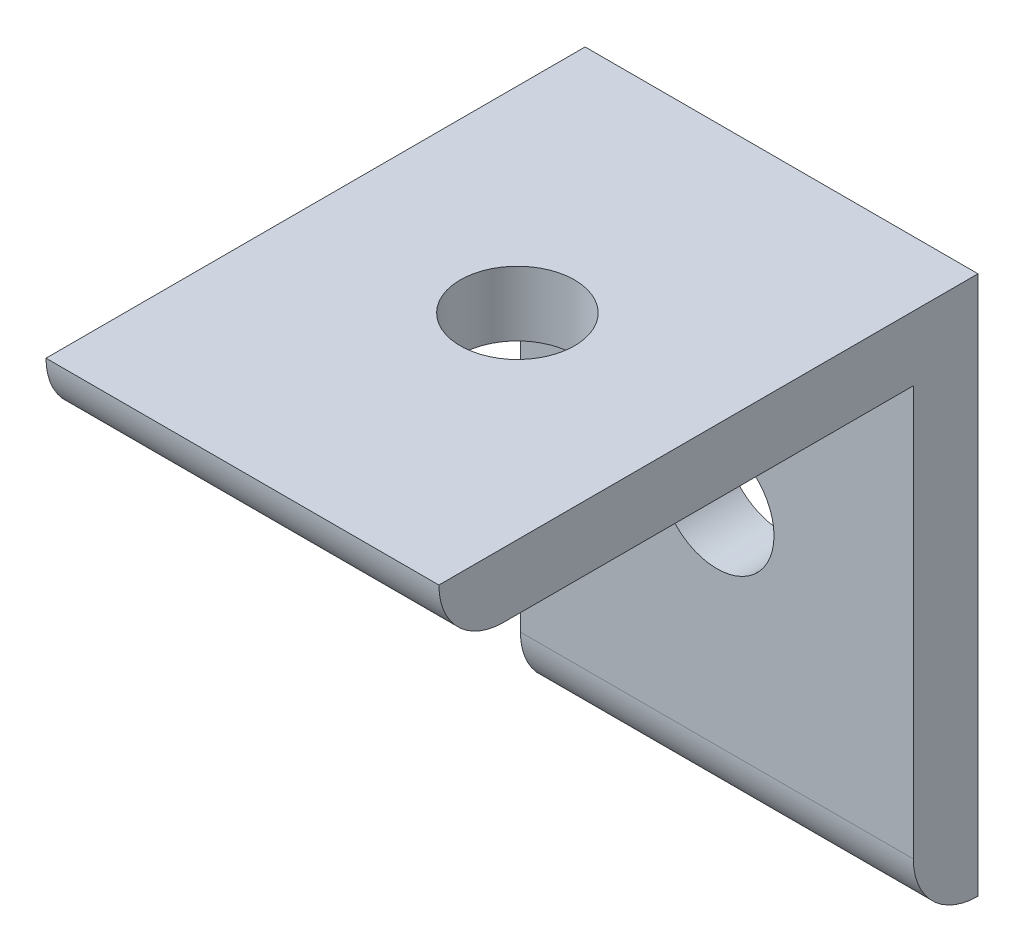
ISO-10303-21;
HEADER;
FILE_DESCRIPTION(('STEP AP214'),'2;1');
FILE_NAME('part.step','',(''),(''),'','','');
FILE_SCHEMA(('AUTOMOTIVE_DESIGN { 1 0 10303 214 1 1 1 1 }'));
ENDSEC;
DATA;
#1=APPLICATION_CONTEXT('core data for automotive mechanical design processes');
#2=APPLICATION_PROTOCOL_DEFINITION('international standard','automotive_design',2000,#1);
#3=PRODUCT_CONTEXT('',#1,'mechanical');
#4=PRODUCT('Part','Part','',(#3));
#5=PRODUCT_RELATED_PRODUCT_CATEGORY('part','',(#4));
#6=PRODUCT_DEFINITION_FORMATION('','',#4);
#7=PRODUCT_DEFINITION_CONTEXT('part definition',#1,'design');
#8=PRODUCT_DEFINITION('design','',#6,#7);
#9=PRODUCT_DEFINITION_SHAPE('','',#8);
#10=(LENGTH_UNIT() NAMED_UNIT(*) SI_UNIT(.MILLI.,.METRE.));
#11=(NAMED_UNIT(*) PLANE_ANGLE_UNIT() SI_UNIT($,.RADIAN.));
#12=(NAMED_UNIT(*) SI_UNIT($,.STERADIAN.) SOLID_ANGLE_UNIT());
#13=UNCERTAINTY_MEASURE_WITH_UNIT(LENGTH_MEASURE(1.E-05),#10,'distance_accuracy_value','');
#14=(GEOMETRIC_REPRESENTATION_CONTEXT(3) GLOBAL_UNCERTAINTY_ASSIGNED_CONTEXT((#13)) GLOBAL_UNIT_ASSIGNED_CONTEXT((#10,
#11,#12)) REPRESENTATION_CONTEXT('',''));
#15=CARTESIAN_POINT('',(0.,0.,0.));
#16=DIRECTION('',(0.,0.,1.));
#17=DIRECTION('',(1.,0.,0.));
#18=AXIS2_PLACEMENT_3D('',#15,#16,#17);
#19=CARTESIAN_POINT('',(-88.5808864008386,-309.665681156461,3.));
#20=DIRECTION('',(1.,0.,0.));
#21=DIRECTION('',(0.,0.,-1.));
#22=AXIS2_PLACEMENT_3D('',#19,#20,#21);
#23=PLANE('',#22);
#24=DIRECTION('',(0.,0.,-1.));
#25=VECTOR('',#24,1.);
#26=CARTESIAN_POINT('',(-88.5808864008386,-312.665681156461,25.));
#27=LINE('',#26,#25);
#28=CARTESIAN_POINT('',(-88.5808864008386,-312.665681156461,22.));
#29=VERTEX_POINT('',#28);
#30=CARTESIAN_POINT('',(-88.5808864008386,-312.665681156461,3.));
#31=VERTEX_POINT('',#30);
#32=EDGE_CURVE('E115',#29,#31,#27,.T.);
#33=ORIENTED_EDGE('',*,*,#32,.F.);
#34=CARTESIAN_POINT('',(-88.5808864008386,-309.665681156461,22.));
#35=DIRECTION('',(1.,0.,0.));
#36=DIRECTION('',(0.,0.,-1.));
#37=AXIS2_PLACEMENT_3D('',#34,#35,#36);
#38=CIRCLE('',#37,3.);
#39=CARTESIAN_POINT('',(-88.5808864008386,-309.665681156461,25.));
#40=VERTEX_POINT('',#39);
#41=EDGE_CURVE('E43',#29,#40,#38,.F.);
#42=ORIENTED_EDGE('',*,*,#41,.T.);
#43=DIRECTION('',(0.,0.,-1.));
#44=VECTOR('',#43,1.);
#45=CARTESIAN_POINT('',(-88.5808864008386,-309.665681156461,3.));
#46=LINE('',#45,#44);
#47=CARTESIAN_POINT('',(-88.5808864008386,-309.665681156461,0.));
#48=VERTEX_POINT('',#47);
#49=EDGE_CURVE('E107',#40,#48,#46,.T.);
#50=ORIENTED_EDGE('',*,*,#49,.T.);
#51=DIRECTION('',(0.,-1.,0.));
#52=VECTOR('',#51,1.);
#53=CARTESIAN_POINT('',(-88.5808864008386,-309.665681156461,0.));
#54=LINE('',#53,#52);
#55=CARTESIAN_POINT('',(-88.5808864008386,-334.665681156461,0.));
#56=VERTEX_POINT('',#55);
#57=EDGE_CURVE('E140',#48,#56,#54,.T.);
#58=ORIENTED_EDGE('',*,*,#57,.T.);
#59=CARTESIAN_POINT('',(-88.5808864008386,-331.665681156461,0.));
#60=DIRECTION('',(1.,0.,0.));
#61=DIRECTION('',(0.,0.,-1.));
#62=AXIS2_PLACEMENT_3D('',#59,#60,#61);
#63=CIRCLE('',#62,3.);
#64=CARTESIAN_POINT('',(-88.5808864008386,-331.665681156461,3.));
#65=VERTEX_POINT('',#64);
#66=EDGE_CURVE('E50',#56,#65,#63,.F.);
#67=ORIENTED_EDGE('',*,*,#66,.T.);
#68=DIRECTION('',(0.,-1.,0.));
#69=VECTOR('',#68,1.);
#70=CARTESIAN_POINT('',(-88.5808864008386,-309.665681156461,3.));
#71=LINE('',#70,#69);
#72=EDGE_CURVE('E130',#31,#65,#71,.T.);
#73=ORIENTED_EDGE('',*,*,#72,.F.);
#74=EDGE_LOOP('',(#33,#42,#50,#58,#67,#73));
#75=FACE_BOUND('',#74,.T.);
#76=ADVANCED_FACE('F35',(#75),#23,.F.);
#77=CARTESIAN_POINT('',(-70.3608864008386,-309.665681156461,3.));
#78=DIRECTION('',(-1.,0.,0.));
#79=DIRECTION('',(0.,0.,1.));
#80=AXIS2_PLACEMENT_3D('',#77,#78,#79);
#81=PLANE('',#80);
#82=DIRECTION('',(0.,0.,-1.));
#83=VECTOR('',#82,1.);
#84=CARTESIAN_POINT('',(-70.3608864008386,-309.665681156461,3.));
#85=LINE('',#84,#83);
#86=CARTESIAN_POINT('',(-70.3608864008386,-309.665681156461,25.));
#87=VERTEX_POINT('',#86);
#88=CARTESIAN_POINT('',(-70.3608864008386,-309.665681156461,0.));
#89=VERTEX_POINT('',#88);
#90=EDGE_CURVE('E101',#87,#89,#85,.T.);
#91=ORIENTED_EDGE('',*,*,#90,.F.);
#92=CARTESIAN_POINT('',(-70.3608864008386,-309.665681156461,22.));
#93=DIRECTION('',(-1.,0.,0.));
#94=DIRECTION('',(0.,0.,1.));
#95=AXIS2_PLACEMENT_3D('',#92,#93,#94);
#96=CIRCLE('',#95,3.);
#97=CARTESIAN_POINT('',(-70.3608864008386,-312.665681156461,22.));
#98=VERTEX_POINT('',#97);
#99=EDGE_CURVE('E90',#87,#98,#96,.F.);
#100=ORIENTED_EDGE('',*,*,#99,.T.);
#101=DIRECTION('',(0.,0.,-1.));
#102=VECTOR('',#101,1.);
#103=CARTESIAN_POINT('',(-70.3608864008386,-312.665681156461,25.));
#104=LINE('',#103,#102);
#105=CARTESIAN_POINT('',(-70.3608864008386,-312.665681156461,3.));
#106=VERTEX_POINT('',#105);
#107=EDGE_CURVE('E112',#98,#106,#104,.T.);
#108=ORIENTED_EDGE('',*,*,#107,.T.);
#109=DIRECTION('',(0.,1.,0.));
#110=VECTOR('',#109,1.);
#111=CARTESIAN_POINT('',(-70.3608864008386,-309.665681156461,3.));
#112=LINE('',#111,#110);
#113=CARTESIAN_POINT('',(-70.3608864008386,-331.665681156461,3.));
#114=VERTEX_POINT('',#113);
#115=EDGE_CURVE('E136',#114,#106,#112,.T.);
#116=ORIENTED_EDGE('',*,*,#115,.F.);
#117=CARTESIAN_POINT('',(-70.3608864008386,-331.665681156461,0.));
#118=DIRECTION('',(-1.,0.,0.));
#119=DIRECTION('',(0.,0.,1.));
#120=AXIS2_PLACEMENT_3D('',#117,#118,#119);
#121=CIRCLE('',#120,3.);
#122=CARTESIAN_POINT('',(-70.3608864008386,-334.665681156461,0.));
#123=VERTEX_POINT('',#122);
#124=EDGE_CURVE('E98',#114,#123,#121,.F.);
#125=ORIENTED_EDGE('',*,*,#124,.T.);
#126=DIRECTION('',(0.,1.,0.));
#127=VECTOR('',#126,1.);
#128=CARTESIAN_POINT('',(-70.3608864008386,-309.665681156461,0.));
#129=LINE('',#128,#127);
#130=EDGE_CURVE('E104',#123,#89,#129,.T.);
#131=ORIENTED_EDGE('',*,*,#130,.T.);
#132=EDGE_LOOP('',(#91,#100,#108,#116,#125,#131));
#133=FACE_BOUND('',#132,.T.);
#134=ADVANCED_FACE('F102',(#133),#81,.F.);
#135=CARTESIAN_POINT('',(-88.5808864008386,-309.665681156461,3.));
#136=DIRECTION('',(0.,-1.,0.));
#137=DIRECTION('',(0.,0.,-1.));
#138=AXIS2_PLACEMENT_3D('',#135,#136,#137);
#139=PLANE('',#138);
#140=CARTESIAN_POINT('',(-79.4708864008386,-309.665681156461,12.25));
#141=DIRECTION('',(0.,-1.,0.));
#142=DIRECTION('',(0.,0.,-1.));
#143=AXIS2_PLACEMENT_3D('',#140,#141,#142);
#144=CIRCLE('',#143,2.65);
#145=CARTESIAN_POINT('',(-79.4708864008386,-309.665681156461,9.6));
#146=VERTEX_POINT('',#145);
#147=EDGE_CURVE('E202',#146,#146,#144,.T.);
#148=ORIENTED_EDGE('',*,*,#147,.T.);
#149=EDGE_LOOP('',(#148));
#150=FACE_BOUND('',#149,.T.);
#151=DIRECTION('',(-1.,0.,0.));
#152=VECTOR('',#151,1.);
#153=CARTESIAN_POINT('',(-88.5808864008386,-309.665681156461,0.));
#154=LINE('',#153,#152);
#155=EDGE_CURVE('E146',#89,#48,#154,.T.);
#156=ORIENTED_EDGE('',*,*,#155,.T.);
#157=ORIENTED_EDGE('',*,*,#49,.F.);
#158=DIRECTION('',(-1.,0.,0.));
#159=VECTOR('',#158,1.);
#160=CARTESIAN_POINT('',(-88.5808864008386,-309.665681156461,25.));
#161=LINE('',#160,#159);
#162=EDGE_CURVE('E95',#87,#40,#161,.T.);
#163=ORIENTED_EDGE('',*,*,#162,.F.);
#164=ORIENTED_EDGE('',*,*,#90,.T.);
#165=EDGE_LOOP('',(#156,#157,#163,#164));
#166=FACE_BOUND('',#165,.T.);
#167=ADVANCED_FACE('F110',(#150,#166),#139,.F.);
#168=CARTESIAN_POINT('',(0.,0.,3.));
#169=DIRECTION('',(0.,0.,1.));
#170=DIRECTION('',(1.,0.,0.));
#171=AXIS2_PLACEMENT_3D('',#168,#169,#170);
#172=PLANE('',#171);
#173=CARTESIAN_POINT('',(-79.4708864008386,-321.91568115646,3.));
#174=DIRECTION('',(0.,0.,1.));
#175=DIRECTION('',(1.,0.,0.));
#176=AXIS2_PLACEMENT_3D('',#173,#174,#175);
#177=CIRCLE('',#176,2.65);
#178=CARTESIAN_POINT('',(-76.8208864008386,-321.91568115646,3.));
#179=VERTEX_POINT('',#178);
#180=EDGE_CURVE('E122',#179,#179,#177,.T.);
#181=ORIENTED_EDGE('',*,*,#180,.F.);
#182=EDGE_LOOP('',(#181));
#183=FACE_BOUND('',#182,.T.);
#184=ORIENTED_EDGE('',*,*,#72,.T.);
#185=DIRECTION('',(1.,0.,0.));
#186=VECTOR('',#185,1.);
#187=CARTESIAN_POINT('',(-70.3608864008386,-331.665681156461,3.));
#188=LINE('',#187,#186);
#189=EDGE_CURVE('E11',#65,#114,#188,.T.);
#190=ORIENTED_EDGE('',*,*,#189,.T.);
#191=ORIENTED_EDGE('',*,*,#115,.T.);
#192=DIRECTION('',(1.,0.,0.));
#193=VECTOR('',#192,1.);
#194=CARTESIAN_POINT('',(-88.5808864008386,-312.665681156461,3.));
#195=LINE('',#194,#193);
#196=EDGE_CURVE('E113',#31,#106,#195,.T.);
#197=ORIENTED_EDGE('',*,*,#196,.F.);
#198=EDGE_LOOP('',(#184,#190,#191,#197));
#199=FACE_BOUND('',#198,.T.);
#200=ADVANCED_FACE('F159',(#183,#199),#172,.T.);
#201=CARTESIAN_POINT('',(0.,0.,0.));
#202=DIRECTION('',(0.,0.,1.));
#203=DIRECTION('',(1.,0.,0.));
#204=AXIS2_PLACEMENT_3D('',#201,#202,#203);
#205=PLANE('',#204);
#206=CARTESIAN_POINT('',(-79.4708864008386,-321.91568115646,0.));
#207=DIRECTION('',(0.,0.,1.));
#208=DIRECTION('',(1.,0.,0.));
#209=AXIS2_PLACEMENT_3D('',#206,#207,#208);
#210=CIRCLE('',#209,2.65);
#211=CARTESIAN_POINT('',(-76.8208864008386,-321.91568115646,0.));
#212=VERTEX_POINT('',#211);
#213=EDGE_CURVE('E118',#212,#212,#210,.T.);
#214=ORIENTED_EDGE('',*,*,#213,.T.);
#215=EDGE_LOOP('',(#214));
#216=FACE_BOUND('',#215,.T.);
#217=ORIENTED_EDGE('',*,*,#57,.F.);
#218=ORIENTED_EDGE('',*,*,#155,.F.);
#219=ORIENTED_EDGE('',*,*,#130,.F.);
#220=DIRECTION('',(1.,0.,0.));
#221=VECTOR('',#220,1.);
#222=CARTESIAN_POINT('',(-88.5808864008386,-334.665681156461,0.));
#223=LINE('',#222,#221);
#224=EDGE_CURVE('E142',#56,#123,#223,.T.);
#225=ORIENTED_EDGE('',*,*,#224,.F.);
#226=EDGE_LOOP('',(#217,#218,#219,#225));
#227=FACE_BOUND('',#226,.T.);
#228=ADVANCED_FACE('F150',(#216,#227),#205,.F.);
#229=CARTESIAN_POINT('',(-88.5808864008386,-312.665681156461,25.));
#230=DIRECTION('',(0.,1.,0.));
#231=DIRECTION('',(0.,0.,1.));
#232=AXIS2_PLACEMENT_3D('',#229,#230,#231);
#233=PLANE('',#232);
#234=CARTESIAN_POINT('',(-79.4708864008386,-312.665681156461,12.25));
#235=DIRECTION('',(0.,-1.,0.));
#236=DIRECTION('',(0.,0.,-1.));
#237=AXIS2_PLACEMENT_3D('',#234,#235,#236);
#238=CIRCLE('',#237,2.65);
#239=CARTESIAN_POINT('',(-79.4708864008386,-312.665681156461,9.6));
#240=VERTEX_POINT('',#239);
#241=EDGE_CURVE('E201',#240,#240,#238,.T.);
#242=ORIENTED_EDGE('',*,*,#241,.F.);
#243=EDGE_LOOP('',(#242));
#244=FACE_BOUND('',#243,.T.);
#245=ORIENTED_EDGE('',*,*,#107,.F.);
#246=DIRECTION('',(1.,0.,0.));
#247=VECTOR('',#246,1.);
#248=CARTESIAN_POINT('',(-88.5808864008386,-312.665681156461,22.));
#249=LINE('',#248,#247);
#250=EDGE_CURVE('E58',#98,#29,#249,.F.);
#251=ORIENTED_EDGE('',*,*,#250,.T.);
#252=ORIENTED_EDGE('',*,*,#32,.T.);
#253=ORIENTED_EDGE('',*,*,#196,.T.);
#254=EDGE_LOOP('',(#245,#251,#252,#253));
#255=FACE_BOUND('',#254,.T.);
#256=ADVANCED_FACE('F157',(#244,#255),#233,.F.);
#257=CARTESIAN_POINT('',(-79.4708864008386,-321.91568115646,-22.));
#258=DIRECTION('',(0.,0.,1.));
#259=DIRECTION('',(1.,0.,0.));
#260=AXIS2_PLACEMENT_3D('',#257,#258,#259);
#261=CYLINDRICAL_SURFACE('',#260,2.65);
#262=ORIENTED_EDGE('',*,*,#180,.T.);
#263=EDGE_LOOP('',(#262));
#264=FACE_BOUND('',#263,.T.);
#265=ORIENTED_EDGE('',*,*,#213,.F.);
#266=EDGE_LOOP('',(#265));
#267=FACE_BOUND('',#266,.T.);
#268=ADVANCED_FACE('F186',(#264,#267),#261,.F.);
#269=CARTESIAN_POINT('',(-79.4708864008386,-287.66568115646,12.25));
#270=DIRECTION('',(0.,-1.,0.));
#271=DIRECTION('',(0.,0.,-1.));
#272=AXIS2_PLACEMENT_3D('',#269,#270,#271);
#273=CYLINDRICAL_SURFACE('',#272,2.65);
#274=ORIENTED_EDGE('',*,*,#241,.T.);
#275=EDGE_LOOP('',(#274));
#276=FACE_BOUND('',#275,.T.);
#277=ORIENTED_EDGE('',*,*,#147,.F.);
#278=EDGE_LOOP('',(#277));
#279=FACE_BOUND('',#278,.T.);
#280=ADVANCED_FACE('F181',(#276,#279),#273,.F.);
#281=CARTESIAN_POINT('',(0.,-309.665681156461,22.));
#282=DIRECTION('',(-1.,0.,0.));
#283=DIRECTION('',(0.,0.,1.));
#284=AXIS2_PLACEMENT_3D('',#281,#282,#283);
#285=CYLINDRICAL_SURFACE('',#284,3.);
#286=ORIENTED_EDGE('',*,*,#41,.F.);
#287=ORIENTED_EDGE('',*,*,#250,.F.);
#288=ORIENTED_EDGE('',*,*,#99,.F.);
#289=ORIENTED_EDGE('',*,*,#162,.T.);
#290=EDGE_LOOP('',(#286,#287,#288,#289));
#291=FACE_BOUND('',#290,.T.);
#292=ADVANCED_FACE('F93',(#291),#285,.T.);
#293=CARTESIAN_POINT('',(0.,-331.665681156461,0.));
#294=DIRECTION('',(-1.,0.,0.));
#295=DIRECTION('',(0.,0.,1.));
#296=AXIS2_PLACEMENT_3D('',#293,#294,#295);
#297=CYLINDRICAL_SURFACE('',#296,3.);
#298=ORIENTED_EDGE('',*,*,#66,.F.);
#299=ORIENTED_EDGE('',*,*,#224,.T.);
#300=ORIENTED_EDGE('',*,*,#124,.F.);
#301=ORIENTED_EDGE('',*,*,#189,.F.);
#302=EDGE_LOOP('',(#298,#299,#300,#301));
#303=FACE_BOUND('',#302,.T.);
#304=ADVANCED_FACE('F37',(#303),#297,.T.);
#305=CLOSED_SHELL('',(#76,#134,#167,#200,#228,#256,#268,#280,#292,#304));
#306=MANIFOLD_SOLID_BREP('B2',#305);
#307=ADVANCED_BREP_SHAPE_REPRESENTATION('',(#18,#306),#14);
#308=SHAPE_DEFINITION_REPRESENTATION(#9,#307);
ENDSEC;
END-ISO-10303-21;
